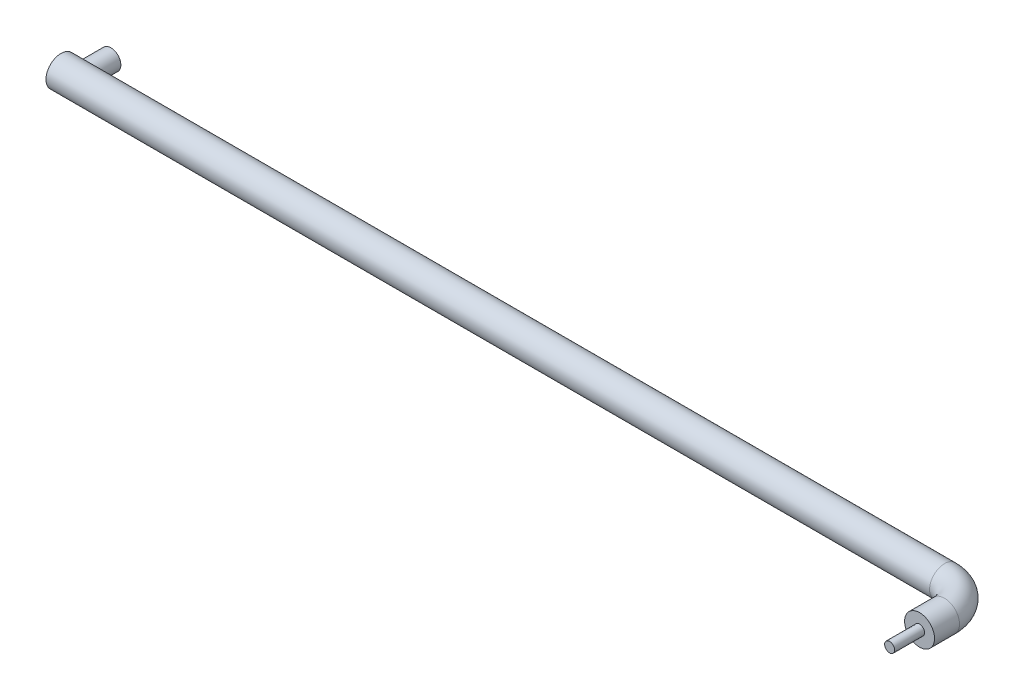
ISO-10303-21;
HEADER;
FILE_DESCRIPTION(('STEP AP214'),'2;1');
FILE_NAME('part.step','',(''),(''),'','','');
FILE_SCHEMA(('AUTOMOTIVE_DESIGN { 1 0 10303 214 1 1 1 1 }'));
ENDSEC;
DATA;
#1=APPLICATION_CONTEXT('core data for automotive mechanical design processes');
#2=APPLICATION_PROTOCOL_DEFINITION('international standard','automotive_design',2000,#1);
#3=PRODUCT_CONTEXT('',#1,'mechanical');
#4=PRODUCT('Part','Part','',(#3));
#5=PRODUCT_RELATED_PRODUCT_CATEGORY('part','',(#4));
#6=PRODUCT_DEFINITION_FORMATION('','',#4);
#7=PRODUCT_DEFINITION_CONTEXT('part definition',#1,'design');
#8=PRODUCT_DEFINITION('design','',#6,#7);
#9=PRODUCT_DEFINITION_SHAPE('','',#8);
#10=(LENGTH_UNIT() NAMED_UNIT(*) SI_UNIT(.MILLI.,.METRE.));
#11=(NAMED_UNIT(*) PLANE_ANGLE_UNIT() SI_UNIT($,.RADIAN.));
#12=(NAMED_UNIT(*) SI_UNIT($,.STERADIAN.) SOLID_ANGLE_UNIT());
#13=UNCERTAINTY_MEASURE_WITH_UNIT(LENGTH_MEASURE(1.E-05),#10,'distance_accuracy_value','');
#14=(GEOMETRIC_REPRESENTATION_CONTEXT(3) GLOBAL_UNCERTAINTY_ASSIGNED_CONTEXT((#13)) GLOBAL_UNIT_ASSIGNED_CONTEXT((#10,
#11,#12)) REPRESENTATION_CONTEXT('',''));
#15=CARTESIAN_POINT('',(0.,0.,0.));
#16=DIRECTION('',(0.,0.,1.));
#17=DIRECTION('',(1.,0.,0.));
#18=AXIS2_PLACEMENT_3D('',#15,#16,#17);
#19=CARTESIAN_POINT('',(0.,0.,0.));
#20=DIRECTION('',(1.,0.,0.));
#21=DIRECTION('',(0.,0.,-1.));
#22=AXIS2_PLACEMENT_3D('',#19,#20,#21);
#23=PLANE('',#22);
#24=CARTESIAN_POINT('',(0.,0.,0.));
#25=DIRECTION('',(1.,0.,0.));
#26=DIRECTION('',(0.,0.,-1.));
#27=AXIS2_PLACEMENT_3D('',#24,#25,#26);
#28=CIRCLE('',#27,15.);
#29=CARTESIAN_POINT('',(0.,0.,-15.));
#30=VERTEX_POINT('',#29);
#31=EDGE_CURVE('E57',#30,#30,#28,.T.);
#32=ORIENTED_EDGE('',*,*,#31,.F.);
#33=EDGE_LOOP('',(#32));
#34=FACE_BOUND('',#33,.T.);
#35=ADVANCED_FACE('F32',(#34),#23,.F.);
#36=CARTESIAN_POINT('',(915.,0.,55.));
#37=DIRECTION('',(0.,0.,1.));
#38=DIRECTION('',(1.,0.,0.));
#39=AXIS2_PLACEMENT_3D('',#36,#37,#38);
#40=PLANE('',#39);
#41=CARTESIAN_POINT('',(915.,0.,55.));
#42=DIRECTION('',(0.,0.,1.));
#43=DIRECTION('',(1.,0.,0.));
#44=AXIS2_PLACEMENT_3D('',#41,#42,#43);
#45=CIRCLE('',#44,5.00000000000004);
#46=CARTESIAN_POINT('',(920.,0.,55.));
#47=VERTEX_POINT('',#46);
#48=EDGE_CURVE('E43',#47,#47,#45,.T.);
#49=ORIENTED_EDGE('',*,*,#48,.F.);
#50=EDGE_LOOP('',(#49));
#51=FACE_BOUND('',#50,.T.);
#52=CARTESIAN_POINT('',(915.,0.,55.));
#53=DIRECTION('',(0.,0.,1.));
#54=DIRECTION('',(1.,0.,0.));
#55=AXIS2_PLACEMENT_3D('',#52,#53,#54);
#56=CIRCLE('',#55,15.);
#57=CARTESIAN_POINT('',(930.,0.,55.));
#58=VERTEX_POINT('',#57);
#59=EDGE_CURVE('E47',#58,#58,#56,.T.);
#60=ORIENTED_EDGE('',*,*,#59,.T.);
#61=EDGE_LOOP('',(#60));
#62=FACE_BOUND('',#61,.T.);
#63=ADVANCED_FACE('F77',(#51,#62),#40,.T.);
#64=CARTESIAN_POINT('',(0.,0.,0.));
#65=DIRECTION('',(1.,0.,0.));
#66=DIRECTION('',(0.,0.,-1.));
#67=AXIS2_PLACEMENT_3D('',#64,#65,#66);
#68=CYLINDRICAL_SURFACE('',#67,15.);
#69=CARTESIAN_POINT('',(5.,0.,-15.));
#70=CARTESIAN_POINT('',(5.00000006465049,0.25121602505803,-14.9999999330355));
#71=CARTESIAN_POINT('',(5.00947905497843,0.50243329641179,-14.9936756382587));
#72=CARTESIAN_POINT('',(5.04724564594306,1.00281430621742,-14.968537725491));
#73=CARTESIAN_POINT('',(5.07553334557533,1.25197803385393,-14.949724041765));
#74=CARTESIAN_POINT('',(5.15049985565046,1.74639437147615,-14.900062607298));
#75=CARTESIAN_POINT('',(5.19718583522666,1.99164541802644,-14.8692101655419));
#76=CARTESIAN_POINT('',(5.30828023961305,2.47636835109205,-14.7962049328406));
#77=CARTESIAN_POINT('',(5.37268887871921,2.71584016768893,-14.7540520052543));
#78=CARTESIAN_POINT('',(5.51803975944265,3.18634157579506,-14.6596225678735));
#79=CARTESIAN_POINT('',(5.59890154498364,3.41740603302261,-14.6073953835842));
#80=CARTESIAN_POINT('',(5.77642068283744,3.87103535608821,-14.4937836667137));
#81=CARTESIAN_POINT('',(5.87307795342936,4.09360026589291,-14.4323991815098));
#82=CARTESIAN_POINT('',(6.08121765618917,4.52919238259836,-14.3016824454347));
#83=CARTESIAN_POINT('',(6.19269771064338,4.74222111188152,-14.2323514695008));
#84=CARTESIAN_POINT('',(6.42960807678473,5.15806897823306,-14.086975078723));
#85=CARTESIAN_POINT('',(6.55504358059917,5.36088427435106,-14.0109271670256));
#86=CARTESIAN_POINT('',(6.83011989287699,5.77229179252596,-13.846795493068));
#87=CARTESIAN_POINT('',(6.98091018757326,5.97992610161555,-13.7582376430911));
#88=CARTESIAN_POINT('',(7.29693388180293,6.38186231730968,-13.5764689970333));
#89=CARTESIAN_POINT('',(7.4621735145659,6.57615840484502,-13.4832562003888));
#90=CARTESIAN_POINT('',(7.80644817351515,6.95109161684713,-13.2938516889865));
#91=CARTESIAN_POINT('',(7.98550127902533,7.13171020600087,-13.1976561722972));
#92=CARTESIAN_POINT('',(8.35646266174879,7.47849345473134,-13.0042893469472));
#93=CARTESIAN_POINT('',(8.54836676546587,7.64466276695229,-12.9071183637111));
#94=CARTESIAN_POINT('',(8.97588618467645,7.98727084465364,-12.6984183321707));
#95=CARTESIAN_POINT('',(9.21361532438438,8.16117931320374,-12.5870482743966));
#96=CARTESIAN_POINT('',(9.70501711634547,8.48824389065339,-12.3688469609622));
#97=CARTESIAN_POINT('',(9.95869336978114,8.64139528736315,-12.2620167396837));
#98=CARTESIAN_POINT('',(10.4808362293973,8.92554542356295,-12.0567536678672));
#99=CARTESIAN_POINT('',(10.7492780762725,9.05657983313836,-11.958307425287));
#100=CARTESIAN_POINT('',(11.3004985077079,9.2953668655437,-11.7736552489426));
#101=CARTESIAN_POINT('',(11.583277609279,9.4031186480483,-11.6874497570146));
#102=CARTESIAN_POINT('',(12.0780248733067,9.56603073076105,-11.554164407184));
#103=CARTESIAN_POINT('',(12.2868604130845,9.62739262612926,-11.5029747857298));
#104=CARTESIAN_POINT('',(12.710062725777,9.73672940324514,-11.4105753109273));
#105=CARTESIAN_POINT('',(12.9244258495664,9.78471288169701,-11.3693590511558));
#106=CARTESIAN_POINT('',(13.3574190214508,9.86663115695275,-11.2983421435493));
#107=CARTESIAN_POINT('',(13.5760434290402,9.90058335814109,-11.2685273567868));
#108=CARTESIAN_POINT('',(14.0164112690882,9.95398099415626,-11.221387591901));
#109=CARTESIAN_POINT('',(14.2381547186332,9.97342634948116,-11.2040626822259));
#110=CARTESIAN_POINT('',(14.6840130974334,9.99750949727822,-11.1825789027742));
#111=CARTESIAN_POINT('',(14.9081340445646,10.0020856379335,-11.1784748508786));
#112=CARTESIAN_POINT('',(15.3560153296719,9.9961699136916,-11.1837650844345));
#113=CARTESIAN_POINT('',(15.5797756664203,9.98567799761094,-11.1931594157374));
#114=CARTESIAN_POINT('',(16.0253125477231,9.94981025476011,-11.2250543429254));
#115=CARTESIAN_POINT('',(16.2470874937965,9.92442336863968,-11.2475646772114));
#116=CARTESIAN_POINT('',(16.686887463286,9.85920094420808,-11.3047790826166));
#117=CARTESIAN_POINT('',(16.9049124151003,9.81936513033175,-11.3394833862946));
#118=CARTESIAN_POINT('',(17.3263077690013,9.72793320006853,-11.4180019094514));
#119=CARTESIAN_POINT('',(17.5298984551306,9.67693962238988,-11.4613417591393));
#120=CARTESIAN_POINT('',(17.9316271224761,9.56290804839144,-11.5566568857338));
#121=CARTESIAN_POINT('',(18.1297632193693,9.49986594811239,-11.6086351042463));
#122=CARTESIAN_POINT('',(18.7149653297061,9.29354494113033,-11.7754502619445));
#123=CARTESIAN_POINT('',(19.0930408957152,9.13302364641689,-11.9012104503488));
#124=CARTESIAN_POINT('',(19.676143758598,8.84272153741117,-12.1171285127346));
#125=CARTESIAN_POINT('',(19.8901626510124,8.72612786560377,-12.2015387549069));
#126=CARTESIAN_POINT('',(20.3078740532256,8.47852404512044,-12.3748717362542));
#127=CARTESIAN_POINT('',(20.5115655859063,8.34751253601214,-12.4637949008305));
#128=CARTESIAN_POINT('',(20.9083786594905,8.07152743445186,-12.6442740511078));
#129=CARTESIAN_POINT('',(21.1014882449079,7.92653854045353,-12.7358328434522));
#130=CARTESIAN_POINT('',(21.4765218987741,7.6231772391138,-12.9196994873306));
#131=CARTESIAN_POINT('',(21.658445372685,7.46480412146615,-13.0120073783843));
#132=CARTESIAN_POINT('',(22.0486515980595,7.09947419488299,-13.2155248866167));
#133=CARTESIAN_POINT('',(22.2541516838068,6.88940798266188,-13.3265151977751));
#134=CARTESIAN_POINT('',(22.6468756715748,6.45073383646428,-13.5442982668685));
#135=CARTESIAN_POINT('',(22.8340962092489,6.22212250338513,-13.6510902499499));
#136=CARTESIAN_POINT('',(23.1887591611842,5.74734305844846,-13.8576700674927));
#137=CARTESIAN_POINT('',(23.3562160661188,5.50118802469019,-13.9574630115838));
#138=CARTESIAN_POINT('',(23.6698826076979,4.99223677264769,-14.1474838136551));
#139=CARTESIAN_POINT('',(23.8160980905592,4.72944516189958,-14.2377143016267));
#140=CARTESIAN_POINT('',(24.059099134101,4.24166531219499,-14.3895846157167));
#141=CARTESIAN_POINT('',(24.1599559795162,4.01936273392655,-14.4533619463413));
#142=CARTESIAN_POINT('',(24.3458176448173,3.56590868996931,-14.5718625564463));
#143=CARTESIAN_POINT('',(24.4308254450017,3.3347588978084,-14.6265875379369));
#144=CARTESIAN_POINT('',(24.5839968963491,2.86496136705682,-14.7258138746381));
#145=CARTESIAN_POINT('',(24.6521712647284,2.6263185086893,-14.7703217334326));
#146=CARTESIAN_POINT('',(24.7708761960258,2.14287716114343,-14.8481652748998));
#147=CARTESIAN_POINT('',(24.8214064875283,1.89807857733481,-14.88150078571));
#148=CARTESIAN_POINT('',(24.9042866568782,1.40298657198257,-14.9363289474097));
#149=CARTESIAN_POINT('',(24.9365560475488,1.1526737995994,-14.9577691603099));
#150=CARTESIAN_POINT('',(24.9820772761936,0.649559957245921,-14.9880478010909));
#151=CARTESIAN_POINT('',(24.9953290893179,0.396758884024646,-14.9968862125054));
#152=CARTESIAN_POINT('',(25.0026040164575,-0.109232368114863,-15.0017358975792));
#153=CARTESIAN_POINT('',(24.9966279230095,-0.362422530565646,-14.9977476999263));
#154=CARTESIAN_POINT('',(24.9655437276184,-0.867090784232965,-14.9770466614902));
#155=CARTESIAN_POINT('',(24.9404364422349,-1.11856894805903,-14.9603343637986));
#156=CARTESIAN_POINT('',(24.8739156350187,-1.60021088099169,-14.9162207256747));
#157=CARTESIAN_POINT('',(24.8337741742413,-1.83062905444839,-14.8896545033154));
#158=CARTESIAN_POINT('',(24.7378170539365,-2.28675079168801,-14.8264553228871));
#159=CARTESIAN_POINT('',(24.6820022766482,-2.51245462006972,-14.7898229314375));
#160=CARTESIAN_POINT('',(24.5553595380821,-2.95782054801539,-14.7072292872384));
#161=CARTESIAN_POINT('',(24.4845331261368,-3.17748326843354,-14.6612689972306));
#162=CARTESIAN_POINT('',(24.3285826248577,-3.609760336539,-14.5608685744981));
#163=CARTESIAN_POINT('',(24.2434529719415,-3.82237190283185,-14.5064251426564));
#164=CARTESIAN_POINT('',(24.0541765998202,-4.25209030381565,-14.3865364468578));
#165=CARTESIAN_POINT('',(23.9491943077867,-4.4686990221519,-14.3206265538465));
#166=CARTESIAN_POINT('',(23.7249613947339,-4.89208194000024,-14.1815800238228));
#167=CARTESIAN_POINT('',(23.6057048016119,-5.0988519722715,-14.1084403642545));
#168=CARTESIAN_POINT('',(23.3538120904024,-5.50184549515242,-13.9562209237832));
#169=CARTESIAN_POINT('',(23.2211726019456,-5.69806630986326,-13.877139647821));
#170=CARTESIAN_POINT('',(22.9433347835417,-6.07939950359023,-13.7143680858164));
#171=CARTESIAN_POINT('',(22.7981350537551,-6.26451064052812,-13.6306772864208));
#172=CARTESIAN_POINT('',(22.4719461972102,-6.65160325692351,-13.4465269082311));
#173=CARTESIAN_POINT('',(22.2889304689086,-6.85161533719513,-13.3455103320206));
#174=CARTESIAN_POINT('',(21.9079647961746,-7.23554778501399,-13.1413134709237));
#175=CARTESIAN_POINT('',(21.7100180394644,-7.41947156934853,-13.0381336512596));
#176=CARTESIAN_POINT('',(21.2997011759732,-7.77089399542675,-12.831786990914));
#177=CARTESIAN_POINT('',(21.0873189232916,-7.93837850837233,-12.7286202362013));
#178=CARTESIAN_POINT('',(20.6488823039421,-8.25611378856013,-12.5248630730048));
#179=CARTESIAN_POINT('',(20.4228293373719,-8.406366316081,-12.4242724021863));
#180=CARTESIAN_POINT('',(19.9772413746228,-8.67693135617692,-12.2366511518776));
#181=CARTESIAN_POINT('',(19.7587714853754,-8.798701217252,-12.1491931829413));
#182=CARTESIAN_POINT('',(19.3112226002501,-9.02642731767801,-11.9809703622396));
#183=CARTESIAN_POINT('',(19.0821434507435,-9.13238332794099,-11.9002056074433));
#184=CARTESIAN_POINT('',(18.6143307135768,-9.32741855584938,-11.7479595311078));
#185=CARTESIAN_POINT('',(18.3756118824671,-9.41652246488609,-11.6764646765776));
#186=CARTESIAN_POINT('',(17.8891374021888,-9.57697422267287,-11.5452295677016));
#187=CARTESIAN_POINT('',(17.6413838448747,-9.64832615207155,-11.4854866126081));
#188=CARTESIAN_POINT('',(17.1834828363798,-9.76102279918068,-11.3897704831431));
#189=CARTESIAN_POINT('',(16.9745828177177,-9.80545611371607,-11.3514548915623));
#190=CARTESIAN_POINT('',(16.5527168245073,-9.8810407113455,-11.2857234393171));
#191=CARTESIAN_POINT('',(16.3397516827063,-9.91219468486488,-11.2583053708654));
#192=CARTESIAN_POINT('',(15.9112455989904,-9.96072687389686,-11.2153901131429));
#193=CARTESIAN_POINT('',(15.6957070954569,-9.97811721936675,-11.1998824275471));
#194=CARTESIAN_POINT('',(15.2634094932499,-9.99887192737887,-11.1813575884869));
#195=CARTESIAN_POINT('',(15.046650376809,-10.0022360852241,-11.1783406173109));
#196=CARTESIAN_POINT('',(14.6134423578542,-9.99487528285886,-11.1849224927768));
#197=CARTESIAN_POINT('',(14.3969937030239,-9.98414227971974,-11.1945285412991));
#198=CARTESIAN_POINT('',(13.9661486872774,-9.94876260555887,-11.2259822212761));
#199=CARTESIAN_POINT('',(13.7517523095516,-9.92411604859886,-11.2478297523767));
#200=CARTESIAN_POINT('',(13.3262563326828,-9.86128176273312,-11.3029581148718));
#201=CARTESIAN_POINT('',(13.1151599394644,-9.82308162817279,-11.3362494199346));
#202=CARTESIAN_POINT('',(12.6975512319337,-9.73367199559206,-11.4131107403506));
#203=CARTESIAN_POINT('',(12.4910416135329,-9.68245505594956,-11.4566866343157));
#204=CARTESIAN_POINT('',(12.0293931182088,-9.55234495109753,-11.5655388267534));
#205=CARTESIAN_POINT('',(11.7759372962068,-9.46971376976683,-11.6335040156423));
#206=CARTESIAN_POINT('',(11.2792787290281,-9.28581809630263,-11.7808083684513));
#207=CARTESIAN_POINT('',(11.0360795590568,-9.18454717174898,-11.8601514566957));
#208=CARTESIAN_POINT('',(10.5605701017574,-8.96438401317387,-12.0274247462764));
#209=CARTESIAN_POINT('',(10.3282714092912,-8.84547355124955,-12.1153637978473));
#210=CARTESIAN_POINT('',(9.87540750928852,-8.59104253624864,-12.2970901291272));
#211=CARTESIAN_POINT('',(9.65484168296936,-8.45552286037769,-12.3908770998534));
#212=CARTESIAN_POINT('',(9.2220185830085,-8.16602291524329,-12.5835943779112));
#213=CARTESIAN_POINT('',(9.00998188649929,-8.01175463180858,-12.6825868303729));
#214=CARTESIAN_POINT('',(8.59892991393828,-7.68731964794005,-12.8818233284634));
#215=CARTESIAN_POINT('',(8.39991956480349,-7.51714699045039,-12.9820678307752));
#216=CARTESIAN_POINT('',(8.01556450490339,-7.16144037138928,-13.1816297875113));
#217=CARTESIAN_POINT('',(7.83022177025721,-6.97590419669871,-13.2809471060737));
#218=CARTESIAN_POINT('',(7.4739792423561,-6.58999024940346,-13.4766033774272));
#219=CARTESIAN_POINT('',(7.30307930313519,-6.38961262683214,-13.5729423603127));
#220=CARTESIAN_POINT('',(6.95311358218994,-5.94464767383283,-13.7742163705596));
#221=CARTESIAN_POINT('',(6.77641059001458,-5.69784749774642,-13.8783939266356));
#222=CARTESIAN_POINT('',(6.44468729845312,-5.18647351593625,-14.0774919665113));
#223=CARTESIAN_POINT('',(6.28967016022105,-4.92189712727176,-14.1724111000986));
#224=CARTESIAN_POINT('',(6.00339478110192,-4.37672916893082,-14.3501334769257));
#225=CARTESIAN_POINT('',(5.87210738152274,-4.09615781925748,-14.4329515653996));
#226=CARTESIAN_POINT('',(5.63509134620802,-3.52068543509657,-14.5840038038843));
#227=CARTESIAN_POINT('',(5.52935373492911,-3.22578947664134,-14.6522430743996));
#228=CARTESIAN_POINT('',(5.36579985749953,-2.69111020627908,-14.7585526216257));
#229=CARTESIAN_POINT('',(5.30255610513208,-2.453635017823,-14.7999572935386));
#230=CARTESIAN_POINT('',(5.1934919181061,-1.97308581148121,-14.8716476970084));
#231=CARTESIAN_POINT('',(5.14766814398633,-1.73001287618556,-14.9019355596521));
#232=CARTESIAN_POINT('',(5.07410331989341,-1.24011776126904,-14.9506744441808));
#233=CARTESIAN_POINT('',(5.04635139706712,-0.993297927604442,-14.9691325832632));
#234=CARTESIAN_POINT('',(5.0092993590436,-0.497652520116127,-14.993795624143));
#235=CARTESIAN_POINT('',(4.99999993596435,-0.248826871409575,-15.0000000663276));
#236=CARTESIAN_POINT('',(5.,0.,-15.));
#237=B_SPLINE_CURVE_WITH_KNOTS('',3,(#69,#70,#71,#72,#73,#74,#75,#76,#77,#78,#79,#80,#81,#82,
#83,#84,#85,#86,#87,#88,#89,#90,#91,#92,#93,#94,#95,#96,#97,#98,#99,#100,#101,#102,#103,#104,
#105,#106,#107,#108,#109,#110,#111,#112,#113,#114,#115,#116,#117,#118,#119,#120,#121,#122,#123,
#124,#125,#126,#127,#128,#129,#130,#131,#132,#133,#134,#135,#136,#137,#138,#139,#140,#141,#142,
#143,#144,#145,#146,#147,#148,#149,#150,#151,#152,#153,#154,#155,#156,#157,#158,#159,#160,#161,
#162,#163,#164,#165,#166,#167,#168,#169,#170,#171,#172,#173,#174,#175,#176,#177,#178,#179,#180,
#181,#182,#183,#184,#185,#186,#187,#188,#189,#190,#191,#192,#193,#194,#195,#196,#197,#198,#199,
#200,#201,#202,#203,#204,#205,#206,#207,#208,#209,#210,#211,#212,#213,#214,#215,#216,#217,#218,
#219,#220,#221,#222,#223,#224,#225,#226,#227,#228,#229,#230,#231,#232,#233,#234,#235,#236),
.UNSPECIFIED.,.T.,.F.,(4,2,2,2,2,2,2,2,2,2,2,2,2,2,2,2,2,2,2,2,2,2,2,2,2,2,2,2,2,2,2,2,2,2,2,2,
2,2,2,2,2,2,2,2,2,2,2,2,2,2,2,2,2,2,2,2,2,2,2,2,2,2,2,2,2,2,2,2,2,2,2,2,2,2,2,2,2,2,2,2,2,2,2,
4),(0.,0.753394300185717,1.50679256573076,2.2604846936234,3.0141859352887,3.76428651453101,
4.51438321311105,5.26435973397233,6.01461622276406,6.82821436912434,7.64216523759396,
8.45720010773051,9.27197155852477,10.2155659725767,11.1593742402419,12.1016454881405,
13.0439507391687,13.7141436311146,14.3839048726875,15.0528328312319,15.7217644556782,
16.3934661372619,17.0651701004973,17.7373734287591,18.4095895777342,19.0518780381327,
19.694385665547,20.9787317460437,21.7519790573574,22.5252993930816,23.2994761376386,
24.0736939939054,25.0149715434141,25.956422009544,26.8971778596538,27.8376742956463,
28.5938374823541,29.3498583343056,30.1053966077372,30.8609465029599,31.6198011453589,
32.3786567793353,33.1374811351664,33.896273104583,34.6016588818499,35.3070049614494,
36.0122782785612,36.7178265661455,37.4657892549015,38.2140659784521,38.9625316217945,
39.7110807894034,40.5781485096025,41.4450316350127,42.3126534000335,43.1801864568224,
43.9743636862577,44.7685524194551,45.5615683509502,46.3544018230502,47.0046896349387,
47.6548456343111,48.3044280077778,48.9540198611609,49.6039824906944,50.2539397919853,
50.9044935435747,51.555420052382,52.3795636043219,53.203992096394,54.0292785280237,
54.8545213914148,55.6945962643172,56.534987061841,57.3754991292032,58.2160027009215,
59.1774341078251,60.1390055171883,61.0993872102032,62.0594310326874,62.8062251677098,
63.5528760678118,64.2990773324883,65.045306585219),.UNSPECIFIED.);
#238=CARTESIAN_POINT('',(5.,0.,-15.));
#239=VERTEX_POINT('',#238);
#240=EDGE_CURVE('E10',#239,#239,#237,.T.);
#241=ORIENTED_EDGE('',*,*,#240,.F.);
#242=EDGE_LOOP('',(#241));
#243=FACE_BOUND('',#242,.T.);
#244=CARTESIAN_POINT('',(885.,0.,0.));
#245=DIRECTION('',(1.,0.,0.));
#246=DIRECTION('',(0.,0.,-1.));
#247=AXIS2_PLACEMENT_3D('',#244,#245,#246);
#248=CIRCLE('',#247,15.);
#249=CARTESIAN_POINT('',(885.,0.,-15.));
#250=VERTEX_POINT('',#249);
#251=EDGE_CURVE('E60',#250,#250,#248,.T.);
#252=ORIENTED_EDGE('',*,*,#251,.F.);
#253=EDGE_LOOP('',(#252));
#254=FACE_BOUND('',#253,.T.);
#255=ORIENTED_EDGE('',*,*,#31,.T.);
#256=EDGE_LOOP('',(#255));
#257=FACE_BOUND('',#256,.T.);
#258=ADVANCED_FACE('F71',(#243,#254,#257),#68,.T.);
#259=CARTESIAN_POINT('',(885.,0.,30.));
#260=DIRECTION('',(0.,-1.,0.));
#261=DIRECTION('',(0.,0.,-1.));
#262=AXIS2_PLACEMENT_3D('',#259,#260,#261);
#263=TOROIDAL_SURFACE('',#262,30.,15.);
#264=CARTESIAN_POINT('',(915.,0.,30.));
#265=DIRECTION('',(0.,0.,1.));
#266=DIRECTION('',(1.,0.,0.));
#267=AXIS2_PLACEMENT_3D('',#264,#265,#266);
#268=CIRCLE('',#267,15.);
#269=CARTESIAN_POINT('',(930.,0.,30.));
#270=VERTEX_POINT('',#269);
#271=EDGE_CURVE('E52',#270,#270,#268,.T.);
#272=CARTESIAN_POINT('',(885.,0.,30.));
#273=DIRECTION('',(0.,-1.,0.));
#274=DIRECTION('',(0.,0.,-1.));
#275=AXIS2_PLACEMENT_3D('',#272,#273,#274);
#276=CIRCLE('',#275,45.);
#277=EDGE_CURVE('',#250,#270,#276,.T.);
#278=ORIENTED_EDGE('',*,*,#251,.T.);
#279=ORIENTED_EDGE('',*,*,#271,.F.);
#280=ORIENTED_EDGE('',*,*,#277,.T.);
#281=ORIENTED_EDGE('',*,*,#277,.F.);
#282=EDGE_LOOP('',(#278,#280,#279,#281));
#283=FACE_BOUND('',#282,.T.);
#284=ADVANCED_FACE('F68',(#283),#263,.T.);
#285=CARTESIAN_POINT('',(915.,0.,30.));
#286=DIRECTION('',(0.,0.,1.));
#287=DIRECTION('',(1.,0.,0.));
#288=AXIS2_PLACEMENT_3D('',#285,#286,#287);
#289=CYLINDRICAL_SURFACE('',#288,15.);
#290=ORIENTED_EDGE('',*,*,#59,.F.);
#291=EDGE_LOOP('',(#290));
#292=FACE_BOUND('',#291,.T.);
#293=ORIENTED_EDGE('',*,*,#271,.T.);
#294=EDGE_LOOP('',(#293));
#295=FACE_BOUND('',#294,.T.);
#296=ADVANCED_FACE('F66',(#292,#295),#289,.T.);
#297=CARTESIAN_POINT('',(915.,0.,85.));
#298=DIRECTION('',(0.,0.,-1.));
#299=DIRECTION('',(-1.,0.,0.));
#300=AXIS2_PLACEMENT_3D('',#297,#298,#299);
#301=CYLINDRICAL_SURFACE('',#300,5.00000000000004);
#302=CARTESIAN_POINT('',(915.,0.,85.));
#303=DIRECTION('',(0.,0.,1.));
#304=DIRECTION('',(1.,0.,0.));
#305=AXIS2_PLACEMENT_3D('',#302,#303,#304);
#306=CIRCLE('',#305,5.00000000000004);
#307=CARTESIAN_POINT('',(920.,0.,85.));
#308=VERTEX_POINT('',#307);
#309=EDGE_CURVE('E55',#308,#308,#306,.T.);
#310=ORIENTED_EDGE('',*,*,#309,.F.);
#311=EDGE_LOOP('',(#310));
#312=FACE_BOUND('',#311,.T.);
#313=ORIENTED_EDGE('',*,*,#48,.T.);
#314=EDGE_LOOP('',(#313));
#315=FACE_BOUND('',#314,.T.);
#316=ADVANCED_FACE('F82',(#312,#315),#301,.T.);
#317=CARTESIAN_POINT('',(915.,0.,85.));
#318=DIRECTION('',(0.,0.,1.));
#319=DIRECTION('',(1.,0.,0.));
#320=AXIS2_PLACEMENT_3D('',#317,#318,#319);
#321=PLANE('',#320);
#322=ORIENTED_EDGE('',*,*,#309,.T.);
#323=EDGE_LOOP('',(#322));
#324=FACE_BOUND('',#323,.T.);
#325=ADVANCED_FACE('F88',(#324),#321,.T.);
#326=CARTESIAN_POINT('',(15.,0.,-35.));
#327=DIRECTION('',(0.,0.,1.));
#328=DIRECTION('',(1.,0.,0.));
#329=AXIS2_PLACEMENT_3D('',#326,#327,#328);
#330=CYLINDRICAL_SURFACE('',#329,10.);
#331=ORIENTED_EDGE('',*,*,#240,.T.);
#332=EDGE_LOOP('',(#331));
#333=FACE_BOUND('',#332,.T.);
#334=CARTESIAN_POINT('',(15.,0.,-35.));
#335=DIRECTION('',(0.,0.,1.));
#336=DIRECTION('',(1.,0.,0.));
#337=AXIS2_PLACEMENT_3D('',#334,#335,#336);
#338=CIRCLE('',#337,10.);
#339=CARTESIAN_POINT('',(25.,0.,-35.));
#340=VERTEX_POINT('',#339);
#341=EDGE_CURVE('E112',#340,#340,#338,.T.);
#342=ORIENTED_EDGE('',*,*,#341,.T.);
#343=EDGE_LOOP('',(#342));
#344=FACE_BOUND('',#343,.T.);
#345=ADVANCED_FACE('F100',(#333,#344),#330,.T.);
#346=CARTESIAN_POINT('',(15.,0.,-35.));
#347=DIRECTION('',(0.,0.,1.));
#348=DIRECTION('',(1.,0.,0.));
#349=AXIS2_PLACEMENT_3D('',#346,#347,#348);
#350=PLANE('',#349);
#351=ORIENTED_EDGE('',*,*,#341,.F.);
#352=EDGE_LOOP('',(#351));
#353=FACE_BOUND('',#352,.T.);
#354=ADVANCED_FACE('F105',(#353),#350,.F.);
#355=CLOSED_SHELL('',(#35,#63,#258,#284,#296,#316,#325,#345,#354));
#356=MANIFOLD_SOLID_BREP('B2',#355);
#357=ADVANCED_BREP_SHAPE_REPRESENTATION('',(#18,#356),#14);
#358=SHAPE_DEFINITION_REPRESENTATION(#9,#357);
ENDSEC;
END-ISO-10303-21;
